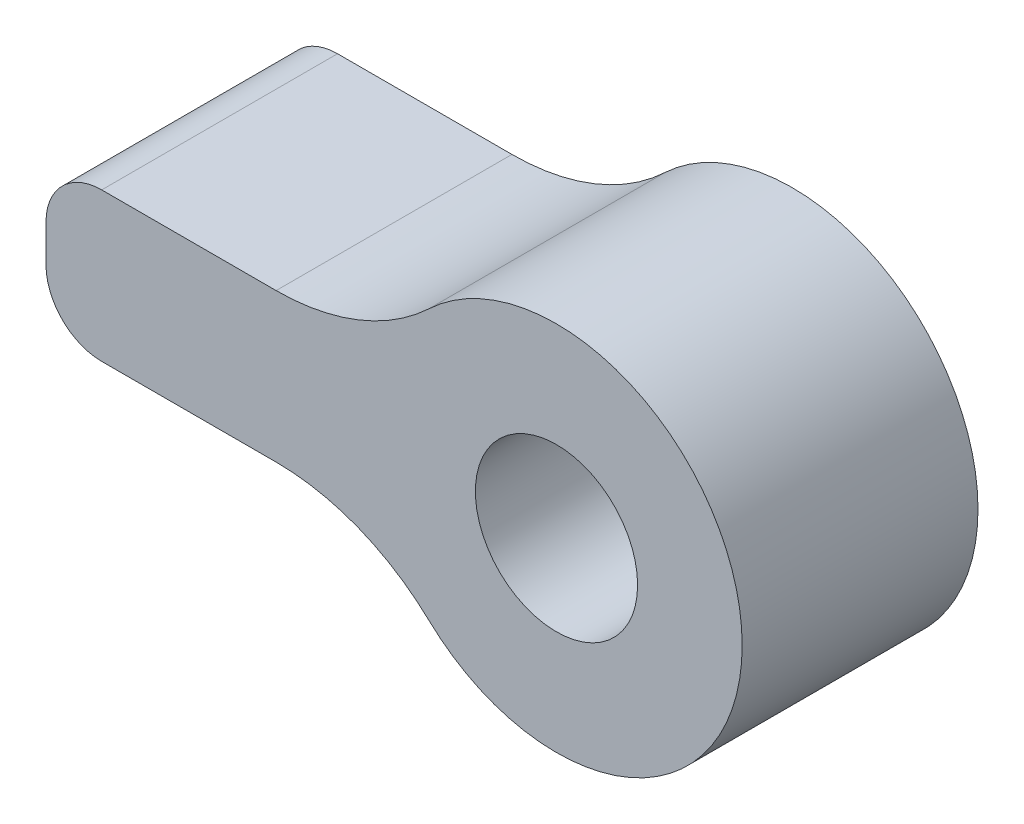
ISO-10303-21;
HEADER;
FILE_DESCRIPTION(('STEP AP214'),'2;1');
FILE_NAME('part.step','',(''),(''),'','','');
FILE_SCHEMA(('AUTOMOTIVE_DESIGN { 1 0 10303 214 1 1 1 1 }'));
ENDSEC;
DATA;
#1=APPLICATION_CONTEXT('core data for automotive mechanical design processes');
#2=APPLICATION_PROTOCOL_DEFINITION('international standard','automotive_design',2000,#1);
#3=PRODUCT_CONTEXT('',#1,'mechanical');
#4=PRODUCT('Part','Part','',(#3));
#5=PRODUCT_RELATED_PRODUCT_CATEGORY('part','',(#4));
#6=PRODUCT_DEFINITION_FORMATION('','',#4);
#7=PRODUCT_DEFINITION_CONTEXT('part definition',#1,'design');
#8=PRODUCT_DEFINITION('design','',#6,#7);
#9=PRODUCT_DEFINITION_SHAPE('','',#8);
#10=(LENGTH_UNIT() NAMED_UNIT(*) SI_UNIT(.MILLI.,.METRE.));
#11=(NAMED_UNIT(*) PLANE_ANGLE_UNIT() SI_UNIT($,.RADIAN.));
#12=(NAMED_UNIT(*) SI_UNIT($,.STERADIAN.) SOLID_ANGLE_UNIT());
#13=UNCERTAINTY_MEASURE_WITH_UNIT(LENGTH_MEASURE(1.E-05),#10,'distance_accuracy_value','');
#14=(GEOMETRIC_REPRESENTATION_CONTEXT(3) GLOBAL_UNCERTAINTY_ASSIGNED_CONTEXT((#13)) GLOBAL_UNIT_ASSIGNED_CONTEXT((#10,
#11,#12)) REPRESENTATION_CONTEXT('',''));
#15=CARTESIAN_POINT('',(0.,0.,0.));
#16=DIRECTION('',(0.,0.,1.));
#17=DIRECTION('',(1.,0.,0.));
#18=AXIS2_PLACEMENT_3D('',#15,#16,#17);
#19=CARTESIAN_POINT('',(97.6173199350894,15.5548331532561,3.175));
#20=DIRECTION('',(0.,0.,-1.));
#21=DIRECTION('',(-1.,0.,0.));
#22=AXIS2_PLACEMENT_3D('',#19,#20,#21);
#23=PLANE('',#22);
#24=CARTESIAN_POINT('',(97.6173199350894,15.5548331532561,3.175));
#25=DIRECTION('',(0.,0.,-1.));
#26=DIRECTION('',(-1.,0.,0.));
#27=AXIS2_PLACEMENT_3D('',#24,#25,#26);
#28=CIRCLE('',#27,3.);
#29=CARTESIAN_POINT('',(97.6173199350894,18.5548331532561,3.175));
#30=VERTEX_POINT('',#29);
#31=CARTESIAN_POINT('',(99.6763656901633,17.7366513350743,3.175));
#32=VERTEX_POINT('',#31);
#33=EDGE_CURVE('E148',#30,#32,#28,.T.);
#34=ORIENTED_EDGE('',*,*,#33,.T.);
#35=CARTESIAN_POINT('',(101.392237152725,19.5548331532561,3.175));
#36=DIRECTION('',(0.,0.,1.));
#37=DIRECTION('',(1.,0.,0.));
#38=AXIS2_PLACEMENT_3D('',#35,#36,#37);
#39=CIRCLE('',#38,2.49999999999999);
#40=CARTESIAN_POINT('',(99.6763656901633,21.3730149714379,3.175));
#41=VERTEX_POINT('',#40);
#42=EDGE_CURVE('E91',#32,#41,#39,.T.);
#43=ORIENTED_EDGE('',*,*,#42,.T.);
#44=CARTESIAN_POINT('',(97.6173199350894,23.5548331532561,3.175));
#45=DIRECTION('',(0.,0.,-1.));
#46=DIRECTION('',(1.,0.,0.));
#47=AXIS2_PLACEMENT_3D('',#44,#45,#46);
#48=CIRCLE('',#47,3.);
#49=CARTESIAN_POINT('',(97.6173199350894,20.5548331532561,3.175));
#50=VERTEX_POINT('',#49);
#51=EDGE_CURVE('E163',#41,#50,#48,.T.);
#52=ORIENTED_EDGE('',*,*,#51,.T.);
#53=DIRECTION('',(-1.,0.,0.));
#54=VECTOR('',#53,1.);
#55=CARTESIAN_POINT('',(97.5192538065174,20.5548331532561,3.175));
#56=LINE('',#55,#54);
#57=CARTESIAN_POINT('',(95.2692538065174,20.5548331532561,3.175));
#58=VERTEX_POINT('',#57);
#59=EDGE_CURVE('E173',#50,#58,#56,.T.);
#60=ORIENTED_EDGE('',*,*,#59,.T.);
#61=CARTESIAN_POINT('',(95.2692538065174,19.8048331532561,3.175));
#62=DIRECTION('',(0.,0.,1.));
#63=DIRECTION('',(-1.,0.,0.));
#64=AXIS2_PLACEMENT_3D('',#61,#62,#63);
#65=CIRCLE('',#64,0.750000000000001);
#66=CARTESIAN_POINT('',(94.5192538065174,19.8048331532561,3.175));
#67=VERTEX_POINT('',#66);
#68=EDGE_CURVE('E111',#58,#67,#65,.T.);
#69=ORIENTED_EDGE('',*,*,#68,.T.);
#70=DIRECTION('',(0.,-1.,0.));
#71=VECTOR('',#70,1.);
#72=CARTESIAN_POINT('',(94.5192538065174,19.8048331532561,3.175));
#73=LINE('',#72,#71);
#74=CARTESIAN_POINT('',(94.5192538065174,19.3048331532561,3.175));
#75=VERTEX_POINT('',#74);
#76=EDGE_CURVE('E104',#67,#75,#73,.T.);
#77=ORIENTED_EDGE('',*,*,#76,.T.);
#78=CARTESIAN_POINT('',(95.2692538065174,19.3048331532561,3.175));
#79=DIRECTION('',(0.,0.,1.));
#80=DIRECTION('',(1.,0.,0.));
#81=AXIS2_PLACEMENT_3D('',#78,#79,#80);
#82=CIRCLE('',#81,0.750000000000001);
#83=CARTESIAN_POINT('',(95.2692538065174,18.5548331532561,3.175));
#84=VERTEX_POINT('',#83);
#85=EDGE_CURVE('E108',#75,#84,#82,.T.);
#86=ORIENTED_EDGE('',*,*,#85,.T.);
#87=DIRECTION('',(1.,0.,0.));
#88=VECTOR('',#87,1.);
#89=CARTESIAN_POINT('',(95.2692538065174,18.5548331532561,3.175));
#90=LINE('',#89,#88);
#91=EDGE_CURVE('E50',#84,#30,#90,.T.);
#92=ORIENTED_EDGE('',*,*,#91,.T.);
#93=EDGE_LOOP('',(#34,#43,#52,#60,#69,#77,#86,#92));
#94=FACE_BOUND('',#93,.T.);
#95=CARTESIAN_POINT('',(101.392237152725,19.5548331532561,3.175));
#96=DIRECTION('',(0.,0.,1.));
#97=DIRECTION('',(1.,0.,0.));
#98=AXIS2_PLACEMENT_3D('',#95,#96,#97);
#99=CIRCLE('',#98,1.0922);
#100=CARTESIAN_POINT('',(102.484437152725,19.5548331532561,3.175));
#101=VERTEX_POINT('',#100);
#102=EDGE_CURVE('E135',#101,#101,#99,.T.);
#103=ORIENTED_EDGE('',*,*,#102,.F.);
#104=EDGE_LOOP('',(#103));
#105=FACE_BOUND('',#104,.T.);
#106=ADVANCED_FACE('F33',(#94,#105),#23,.F.);
#107=CARTESIAN_POINT('',(97.6173199350894,15.5548331532561,0.));
#108=DIRECTION('',(0.,0.,-1.));
#109=DIRECTION('',(-1.,0.,0.));
#110=AXIS2_PLACEMENT_3D('',#107,#108,#109);
#111=PLANE('',#110);
#112=CARTESIAN_POINT('',(97.6173199350894,15.5548331532561,0.));
#113=DIRECTION('',(0.,0.,-1.));
#114=DIRECTION('',(-1.,0.,0.));
#115=AXIS2_PLACEMENT_3D('',#112,#113,#114);
#116=CIRCLE('',#115,3.);
#117=CARTESIAN_POINT('',(97.6173199350894,18.5548331532561,0.));
#118=VERTEX_POINT('',#117);
#119=CARTESIAN_POINT('',(99.6763656901633,17.7366513350743,0.));
#120=VERTEX_POINT('',#119);
#121=EDGE_CURVE('E131',#118,#120,#116,.T.);
#122=ORIENTED_EDGE('',*,*,#121,.F.);
#123=DIRECTION('',(1.,0.,0.));
#124=VECTOR('',#123,1.);
#125=CARTESIAN_POINT('',(97.5192538065174,18.5548331532561,0.));
#126=LINE('',#125,#124);
#127=CARTESIAN_POINT('',(95.2692538065174,18.5548331532561,0.));
#128=VERTEX_POINT('',#127);
#129=EDGE_CURVE('E79',#128,#118,#126,.T.);
#130=ORIENTED_EDGE('',*,*,#129,.F.);
#131=CARTESIAN_POINT('',(95.2692538065174,19.3048331532561,0.));
#132=DIRECTION('',(0.,0.,1.));
#133=DIRECTION('',(1.,0.,0.));
#134=AXIS2_PLACEMENT_3D('',#131,#132,#133);
#135=CIRCLE('',#134,0.750000000000001);
#136=CARTESIAN_POINT('',(94.5192538065174,19.3048331532561,0.));
#137=VERTEX_POINT('',#136);
#138=EDGE_CURVE('E145',#137,#128,#135,.T.);
#139=ORIENTED_EDGE('',*,*,#138,.F.);
#140=DIRECTION('',(0.,-1.,0.));
#141=VECTOR('',#140,1.);
#142=CARTESIAN_POINT('',(94.5192538065174,19.8048331532561,0.));
#143=LINE('',#142,#141);
#144=CARTESIAN_POINT('',(94.5192538065174,19.8048331532561,0.));
#145=VERTEX_POINT('',#144);
#146=EDGE_CURVE('E120',#145,#137,#143,.T.);
#147=ORIENTED_EDGE('',*,*,#146,.F.);
#148=CARTESIAN_POINT('',(95.2692538065174,19.8048331532561,0.));
#149=DIRECTION('',(0.,0.,1.));
#150=DIRECTION('',(-1.,0.,0.));
#151=AXIS2_PLACEMENT_3D('',#148,#149,#150);
#152=CIRCLE('',#151,0.750000000000001);
#153=CARTESIAN_POINT('',(95.2692538065174,20.5548331532561,0.));
#154=VERTEX_POINT('',#153);
#155=EDGE_CURVE('E142',#154,#145,#152,.T.);
#156=ORIENTED_EDGE('',*,*,#155,.F.);
#157=DIRECTION('',(-1.,0.,0.));
#158=VECTOR('',#157,1.);
#159=CARTESIAN_POINT('',(95.2692538065174,20.5548331532561,0.));
#160=LINE('',#159,#158);
#161=CARTESIAN_POINT('',(97.6173199350894,20.5548331532561,0.));
#162=VERTEX_POINT('',#161);
#163=EDGE_CURVE('E140',#162,#154,#160,.T.);
#164=ORIENTED_EDGE('',*,*,#163,.F.);
#165=CARTESIAN_POINT('',(97.6173199350894,23.5548331532561,0.));
#166=DIRECTION('',(0.,0.,-1.));
#167=DIRECTION('',(1.,0.,0.));
#168=AXIS2_PLACEMENT_3D('',#165,#166,#167);
#169=CIRCLE('',#168,3.);
#170=CARTESIAN_POINT('',(99.6763656901633,21.3730149714379,0.));
#171=VERTEX_POINT('',#170);
#172=EDGE_CURVE('E137',#171,#162,#169,.T.);
#173=ORIENTED_EDGE('',*,*,#172,.F.);
#174=CARTESIAN_POINT('',(101.392237152725,19.5548331532561,0.));
#175=DIRECTION('',(0.,0.,1.));
#176=DIRECTION('',(1.,0.,0.));
#177=AXIS2_PLACEMENT_3D('',#174,#175,#176);
#178=CIRCLE('',#177,2.49999999999999);
#179=EDGE_CURVE('E134',#120,#171,#178,.T.);
#180=ORIENTED_EDGE('',*,*,#179,.F.);
#181=EDGE_LOOP('',(#122,#130,#139,#147,#156,#164,#173,#180));
#182=FACE_BOUND('',#181,.T.);
#183=CARTESIAN_POINT('',(101.392237152725,19.5548331532561,0.));
#184=DIRECTION('',(0.,0.,1.));
#185=DIRECTION('',(1.,0.,0.));
#186=AXIS2_PLACEMENT_3D('',#183,#184,#185);
#187=CIRCLE('',#186,1.0922);
#188=CARTESIAN_POINT('',(102.484437152725,19.5548331532561,0.));
#189=VERTEX_POINT('',#188);
#190=EDGE_CURVE('E179',#189,#189,#187,.T.);
#191=ORIENTED_EDGE('',*,*,#190,.T.);
#192=EDGE_LOOP('',(#191));
#193=FACE_BOUND('',#192,.T.);
#194=ADVANCED_FACE('F164',(#182,#193),#111,.T.);
#195=CARTESIAN_POINT('',(97.6173199350894,15.5548331532561,3.175));
#196=DIRECTION('',(0.,0.,-1.));
#197=DIRECTION('',(-1.,0.,0.));
#198=AXIS2_PLACEMENT_3D('',#195,#196,#197);
#199=CYLINDRICAL_SURFACE('',#198,3.);
#200=ORIENTED_EDGE('',*,*,#121,.T.);
#201=DIRECTION('',(0.,0.,-1.));
#202=VECTOR('',#201,1.);
#203=CARTESIAN_POINT('',(99.6763656901633,17.7366513350743,3.175));
#204=LINE('',#203,#202);
#205=EDGE_CURVE('E11',#32,#120,#204,.T.);
#206=ORIENTED_EDGE('',*,*,#205,.F.);
#207=ORIENTED_EDGE('',*,*,#33,.F.);
#208=DIRECTION('',(0.,0.,-1.));
#209=VECTOR('',#208,1.);
#210=CARTESIAN_POINT('',(97.6173199350894,18.5548331532561,3.175));
#211=LINE('',#210,#209);
#212=EDGE_CURVE('E127',#30,#118,#211,.T.);
#213=ORIENTED_EDGE('',*,*,#212,.T.);
#214=EDGE_LOOP('',(#200,#206,#207,#213));
#215=FACE_BOUND('',#214,.T.);
#216=ADVANCED_FACE('F35',(#215),#199,.F.);
#217=CARTESIAN_POINT('',(101.392237152725,19.5548331532561,3.175));
#218=DIRECTION('',(0.,0.,-1.));
#219=DIRECTION('',(-1.,0.,0.));
#220=AXIS2_PLACEMENT_3D('',#217,#218,#219);
#221=CYLINDRICAL_SURFACE('',#220,2.49999999999999);
#222=ORIENTED_EDGE('',*,*,#179,.T.);
#223=DIRECTION('',(0.,0.,-1.));
#224=VECTOR('',#223,1.);
#225=CARTESIAN_POINT('',(99.6763656901633,21.3730149714379,3.175));
#226=LINE('',#225,#224);
#227=EDGE_CURVE('E42',#41,#171,#226,.T.);
#228=ORIENTED_EDGE('',*,*,#227,.F.);
#229=ORIENTED_EDGE('',*,*,#42,.F.);
#230=ORIENTED_EDGE('',*,*,#205,.T.);
#231=EDGE_LOOP('',(#222,#228,#229,#230));
#232=FACE_BOUND('',#231,.T.);
#233=ADVANCED_FACE('F207',(#232),#221,.T.);
#234=CARTESIAN_POINT('',(97.6173199350894,23.5548331532561,3.175));
#235=DIRECTION('',(0.,0.,-1.));
#236=DIRECTION('',(-1.,0.,0.));
#237=AXIS2_PLACEMENT_3D('',#234,#235,#236);
#238=CYLINDRICAL_SURFACE('',#237,3.);
#239=ORIENTED_EDGE('',*,*,#172,.T.);
#240=DIRECTION('',(0.,0.,-1.));
#241=VECTOR('',#240,1.);
#242=CARTESIAN_POINT('',(97.6173199350894,20.5548331532561,3.175));
#243=LINE('',#242,#241);
#244=EDGE_CURVE('E155',#50,#162,#243,.T.);
#245=ORIENTED_EDGE('',*,*,#244,.F.);
#246=ORIENTED_EDGE('',*,*,#51,.F.);
#247=ORIENTED_EDGE('',*,*,#227,.T.);
#248=EDGE_LOOP('',(#239,#245,#246,#247));
#249=FACE_BOUND('',#248,.T.);
#250=ADVANCED_FACE('F161',(#249),#238,.F.);
#251=CARTESIAN_POINT('',(95.2692538065174,20.5548331532561,3.175));
#252=DIRECTION('',(0.,-1.,0.));
#253=DIRECTION('',(0.,0.,-1.));
#254=AXIS2_PLACEMENT_3D('',#251,#252,#253);
#255=PLANE('',#254);
#256=ORIENTED_EDGE('',*,*,#163,.T.);
#257=DIRECTION('',(0.,0.,-1.));
#258=VECTOR('',#257,1.);
#259=CARTESIAN_POINT('',(95.2692538065174,20.5548331532561,3.175));
#260=LINE('',#259,#258);
#261=EDGE_CURVE('E152',#58,#154,#260,.T.);
#262=ORIENTED_EDGE('',*,*,#261,.F.);
#263=ORIENTED_EDGE('',*,*,#59,.F.);
#264=ORIENTED_EDGE('',*,*,#244,.T.);
#265=EDGE_LOOP('',(#256,#262,#263,#264));
#266=FACE_BOUND('',#265,.T.);
#267=ADVANCED_FACE('F169',(#266),#255,.F.);
#268=CARTESIAN_POINT('',(95.2692538065174,19.8048331532561,3.175));
#269=DIRECTION('',(0.,0.,-1.));
#270=DIRECTION('',(-1.,0.,0.));
#271=AXIS2_PLACEMENT_3D('',#268,#269,#270);
#272=CYLINDRICAL_SURFACE('',#271,0.750000000000001);
#273=ORIENTED_EDGE('',*,*,#155,.T.);
#274=DIRECTION('',(0.,0.,-1.));
#275=VECTOR('',#274,1.);
#276=CARTESIAN_POINT('',(94.5192538065174,19.8048331532561,3.175));
#277=LINE('',#276,#275);
#278=EDGE_CURVE('E122',#67,#145,#277,.T.);
#279=ORIENTED_EDGE('',*,*,#278,.F.);
#280=ORIENTED_EDGE('',*,*,#68,.F.);
#281=ORIENTED_EDGE('',*,*,#261,.T.);
#282=EDGE_LOOP('',(#273,#279,#280,#281));
#283=FACE_BOUND('',#282,.T.);
#284=ADVANCED_FACE('F172',(#283),#272,.T.);
#285=CARTESIAN_POINT('',(94.5192538065174,19.8048331532561,3.175));
#286=DIRECTION('',(1.,0.,0.));
#287=DIRECTION('',(0.,0.,-1.));
#288=AXIS2_PLACEMENT_3D('',#285,#286,#287);
#289=PLANE('',#288);
#290=ORIENTED_EDGE('',*,*,#146,.T.);
#291=DIRECTION('',(0.,0.,-1.));
#292=VECTOR('',#291,1.);
#293=CARTESIAN_POINT('',(94.5192538065174,19.3048331532561,3.175));
#294=LINE('',#293,#292);
#295=EDGE_CURVE('E117',#75,#137,#294,.T.);
#296=ORIENTED_EDGE('',*,*,#295,.F.);
#297=ORIENTED_EDGE('',*,*,#76,.F.);
#298=ORIENTED_EDGE('',*,*,#278,.T.);
#299=EDGE_LOOP('',(#290,#296,#297,#298));
#300=FACE_BOUND('',#299,.T.);
#301=ADVANCED_FACE('F118',(#300),#289,.F.);
#302=CARTESIAN_POINT('',(95.2692538065174,19.3048331532561,3.175));
#303=DIRECTION('',(0.,0.,-1.));
#304=DIRECTION('',(-1.,0.,0.));
#305=AXIS2_PLACEMENT_3D('',#302,#303,#304);
#306=CYLINDRICAL_SURFACE('',#305,0.750000000000001);
#307=ORIENTED_EDGE('',*,*,#138,.T.);
#308=DIRECTION('',(0.,0.,-1.));
#309=VECTOR('',#308,1.);
#310=CARTESIAN_POINT('',(95.2692538065174,18.5548331532561,3.175));
#311=LINE('',#310,#309);
#312=EDGE_CURVE('E123',#84,#128,#311,.T.);
#313=ORIENTED_EDGE('',*,*,#312,.F.);
#314=ORIENTED_EDGE('',*,*,#85,.F.);
#315=ORIENTED_EDGE('',*,*,#295,.T.);
#316=EDGE_LOOP('',(#307,#313,#314,#315));
#317=FACE_BOUND('',#316,.T.);
#318=ADVANCED_FACE('F125',(#317),#306,.T.);
#319=CARTESIAN_POINT('',(97.5192538065174,18.5548331532561,3.175));
#320=DIRECTION('',(0.,1.,0.));
#321=DIRECTION('',(0.,0.,1.));
#322=AXIS2_PLACEMENT_3D('',#319,#320,#321);
#323=PLANE('',#322);
#324=ORIENTED_EDGE('',*,*,#129,.T.);
#325=ORIENTED_EDGE('',*,*,#212,.F.);
#326=ORIENTED_EDGE('',*,*,#91,.F.);
#327=ORIENTED_EDGE('',*,*,#312,.T.);
#328=EDGE_LOOP('',(#324,#325,#326,#327));
#329=FACE_BOUND('',#328,.T.);
#330=ADVANCED_FACE('F195',(#329),#323,.F.);
#331=CARTESIAN_POINT('',(101.392237152725,19.5548331532561,3.175));
#332=DIRECTION('',(0.,0.,-1.));
#333=DIRECTION('',(-1.,0.,0.));
#334=AXIS2_PLACEMENT_3D('',#331,#332,#333);
#335=CYLINDRICAL_SURFACE('',#334,1.0922);
#336=ORIENTED_EDGE('',*,*,#102,.T.);
#337=EDGE_LOOP('',(#336));
#338=FACE_BOUND('',#337,.T.);
#339=ORIENTED_EDGE('',*,*,#190,.F.);
#340=EDGE_LOOP('',(#339));
#341=FACE_BOUND('',#340,.T.);
#342=ADVANCED_FACE('F185',(#338,#341),#335,.F.);
#343=CLOSED_SHELL('',(#106,#194,#216,#233,#250,#267,#284,#301,#318,#330,#342));
#344=MANIFOLD_SOLID_BREP('B2',#343);
#345=ADVANCED_BREP_SHAPE_REPRESENTATION('',(#18,#344),#14);
#346=SHAPE_DEFINITION_REPRESENTATION(#9,#345);
ENDSEC;
END-ISO-10303-21;
